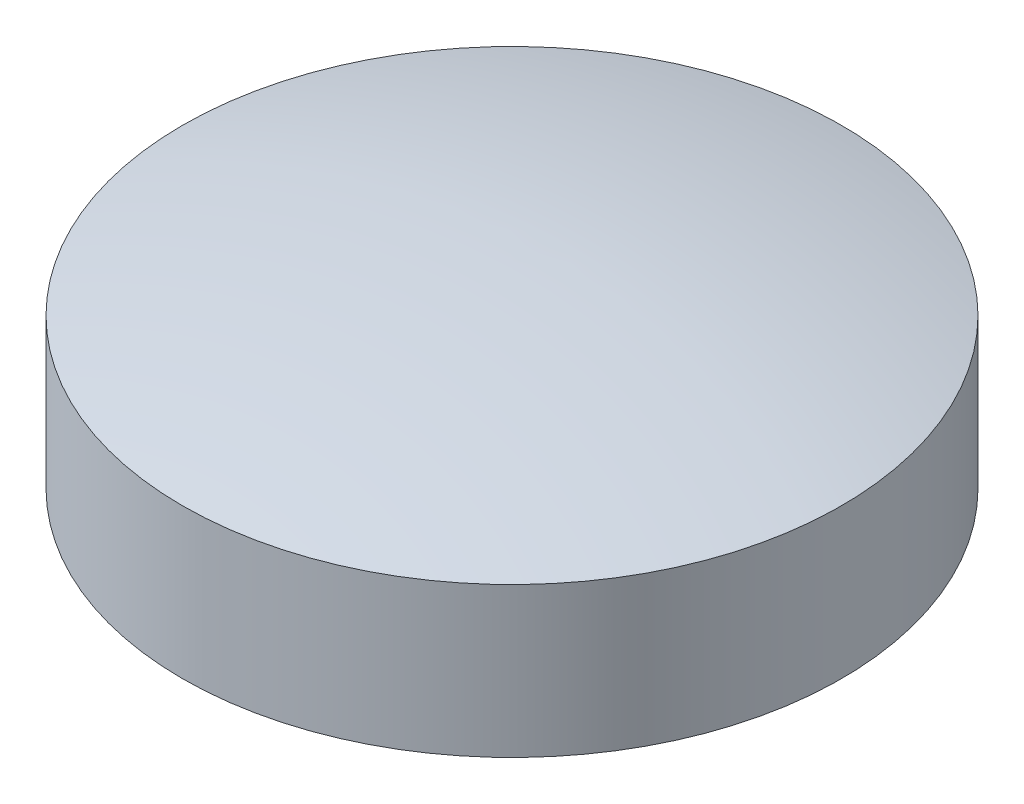
ISO-10303-21;
HEADER;
FILE_DESCRIPTION(('STEP AP214'),'2;1');
FILE_NAME('part.step','',(''),(''),'','','');
FILE_SCHEMA(('AUTOMOTIVE_DESIGN { 1 0 10303 214 1 1 1 1 }'));
ENDSEC;
DATA;
#1=APPLICATION_CONTEXT('core data for automotive mechanical design processes');
#2=APPLICATION_PROTOCOL_DEFINITION('international standard','automotive_design',2000,#1);
#3=PRODUCT_CONTEXT('',#1,'mechanical');
#4=PRODUCT('Part','Part','',(#3));
#5=PRODUCT_RELATED_PRODUCT_CATEGORY('part','',(#4));
#6=PRODUCT_DEFINITION_FORMATION('','',#4);
#7=PRODUCT_DEFINITION_CONTEXT('part definition',#1,'design');
#8=PRODUCT_DEFINITION('design','',#6,#7);
#9=PRODUCT_DEFINITION_SHAPE('','',#8);
#10=(LENGTH_UNIT() NAMED_UNIT(*) SI_UNIT(.MILLI.,.METRE.));
#11=(NAMED_UNIT(*) PLANE_ANGLE_UNIT() SI_UNIT($,.RADIAN.));
#12=(NAMED_UNIT(*) SI_UNIT($,.STERADIAN.) SOLID_ANGLE_UNIT());
#13=UNCERTAINTY_MEASURE_WITH_UNIT(LENGTH_MEASURE(1.E-05),#10,'distance_accuracy_value','');
#14=(GEOMETRIC_REPRESENTATION_CONTEXT(3) GLOBAL_UNCERTAINTY_ASSIGNED_CONTEXT((#13)) GLOBAL_UNIT_ASSIGNED_CONTEXT((#10,
#11,#12)) REPRESENTATION_CONTEXT('',''));
#15=CARTESIAN_POINT('',(0.,0.,0.));
#16=DIRECTION('',(0.,0.,1.));
#17=DIRECTION('',(1.,0.,0.));
#18=AXIS2_PLACEMENT_3D('',#15,#16,#17);
#19=CARTESIAN_POINT('',(0.,0.,0.));
#20=DIRECTION('',(0.,-1.,0.));
#21=DIRECTION('',(0.,0.,-1.));
#22=AXIS2_PLACEMENT_3D('',#19,#20,#21);
#23=PLANE('',#22);
#24=CARTESIAN_POINT('',(-22.,0.,0.));
#25=DIRECTION('',(0.,-1.,0.));
#26=DIRECTION('',(0.,0.,-1.));
#27=AXIS2_PLACEMENT_3D('',#24,#25,#26);
#28=CIRCLE('',#27,1.5);
#29=CARTESIAN_POINT('',(-21.9488636363636,0.,-1.49912810403716));
#30=VERTEX_POINT('',#29);
#31=CARTESIAN_POINT('',(-21.9488636363636,0.,1.49912810403716));
#32=VERTEX_POINT('',#31);
#33=EDGE_CURVE('E59',#30,#32,#28,.T.);
#34=ORIENTED_EDGE('',*,*,#33,.F.);
#35=CARTESIAN_POINT('',(0.,0.,0.));
#36=DIRECTION('',(0.,1.,0.));
#37=DIRECTION('',(0.,0.,1.));
#38=AXIS2_PLACEMENT_3D('',#35,#36,#37);
#39=CIRCLE('',#38,22.);
#40=EDGE_CURVE('E65',#32,#30,#39,.T.);
#41=ORIENTED_EDGE('',*,*,#40,.F.);
#42=EDGE_LOOP('',(#34,#41));
#43=FACE_BOUND('',#42,.T.);
#44=ADVANCED_FACE('F33',(#43),#23,.T.);
#45=CARTESIAN_POINT('',(0.,30.,0.));
#46=DIRECTION('',(0.,1.,0.));
#47=DIRECTION('',(0.,0.,1.));
#48=AXIS2_PLACEMENT_3D('',#45,#46,#47);
#49=CYLINDRICAL_SURFACE('',#48,22.);
#50=DIRECTION('',(0.,-1.,0.));
#51=VECTOR('',#50,1.);
#52=CARTESIAN_POINT('',(-21.9488636363636,2.5,1.49912810403716));
#53=LINE('',#52,#51);
#54=CARTESIAN_POINT('',(-21.9488636363636,5.,1.49912810403716));
#55=VERTEX_POINT('',#54);
#56=EDGE_CURVE('E11',#32,#55,#53,.F.);
#57=ORIENTED_EDGE('',*,*,#56,.F.);
#58=ORIENTED_EDGE('',*,*,#40,.T.);
#59=DIRECTION('',(0.,-1.,0.));
#60=VECTOR('',#59,1.);
#61=CARTESIAN_POINT('',(-21.9488636363636,2.5,-1.49912810403716));
#62=LINE('',#61,#60);
#63=CARTESIAN_POINT('',(-21.9488636363636,5.,-1.49912810403716));
#64=VERTEX_POINT('',#63);
#65=EDGE_CURVE('E40',#64,#30,#62,.T.);
#66=ORIENTED_EDGE('',*,*,#65,.F.);
#67=CARTESIAN_POINT('',(0.,5.,0.));
#68=DIRECTION('',(0.,-1.,0.));
#69=DIRECTION('',(0.,0.,-1.));
#70=AXIS2_PLACEMENT_3D('',#67,#68,#69);
#71=CIRCLE('',#70,22.);
#72=EDGE_CURVE('E49',#64,#55,#71,.F.);
#73=ORIENTED_EDGE('',*,*,#72,.T.);
#74=EDGE_LOOP('',(#57,#58,#66,#73));
#75=FACE_BOUND('',#74,.T.);
#76=CARTESIAN_POINT('',(0.,10.,0.));
#77=DIRECTION('',(0.,1.,0.));
#78=DIRECTION('',(0.,0.,1.));
#79=AXIS2_PLACEMENT_3D('',#76,#77,#78);
#80=CIRCLE('',#79,22.);
#81=CARTESIAN_POINT('',(0.,10.,22.));
#82=VERTEX_POINT('',#81);
#83=EDGE_CURVE('E69',#82,#82,#80,.T.);
#84=ORIENTED_EDGE('',*,*,#83,.F.);
#85=EDGE_LOOP('',(#84));
#86=FACE_BOUND('',#85,.T.);
#87=ADVANCED_FACE('F67',(#75,#86),#49,.T.);
#88=CARTESIAN_POINT('',(0.,-69.1666666666666,0.));
#89=DIRECTION('',(0.,1.,0.));
#90=DIRECTION('',(-1.,0.,0.));
#91=AXIS2_PLACEMENT_3D('',#88,#89,#90);
#92=SPHERICAL_SURFACE('',#91,82.1666666666666);
#93=ORIENTED_EDGE('',*,*,#83,.T.);
#94=EDGE_LOOP('',(#93));
#95=FACE_BOUND('',#94,.T.);
#96=ADVANCED_FACE('F77',(#95),#92,.T.);
#97=CARTESIAN_POINT('',(-22.,5.,0.));
#98=DIRECTION('',(0.,-1.,0.));
#99=DIRECTION('',(0.,0.,-1.));
#100=AXIS2_PLACEMENT_3D('',#97,#98,#99);
#101=CYLINDRICAL_SURFACE('',#100,1.5);
#102=ORIENTED_EDGE('',*,*,#56,.T.);
#103=CARTESIAN_POINT('',(-22.,5.,0.));
#104=DIRECTION('',(0.,-1.,0.));
#105=DIRECTION('',(0.,0.,-1.));
#106=AXIS2_PLACEMENT_3D('',#103,#104,#105);
#107=CIRCLE('',#106,1.5);
#108=EDGE_CURVE('E46',#64,#55,#107,.T.);
#109=ORIENTED_EDGE('',*,*,#108,.F.);
#110=ORIENTED_EDGE('',*,*,#65,.T.);
#111=ORIENTED_EDGE('',*,*,#33,.T.);
#112=EDGE_LOOP('',(#102,#109,#110,#111));
#113=FACE_BOUND('',#112,.T.);
#114=ADVANCED_FACE('F58',(#113),#101,.F.);
#115=CARTESIAN_POINT('',(-22.,5.,0.));
#116=DIRECTION('',(0.,-1.,0.));
#117=DIRECTION('',(0.,0.,-1.));
#118=AXIS2_PLACEMENT_3D('',#115,#116,#117);
#119=PLANE('',#118);
#120=ORIENTED_EDGE('',*,*,#108,.T.);
#121=ORIENTED_EDGE('',*,*,#72,.F.);
#122=EDGE_LOOP('',(#120,#121));
#123=FACE_BOUND('',#122,.T.);
#124=ADVANCED_FACE('F87',(#123),#119,.T.);
#125=CLOSED_SHELL('',(#44,#87,#96,#114,#124));
#126=MANIFOLD_SOLID_BREP('B2',#125);
#127=ADVANCED_BREP_SHAPE_REPRESENTATION('',(#18,#126),#14);
#128=SHAPE_DEFINITION_REPRESENTATION(#9,#127);
ENDSEC;
END-ISO-10303-21;
